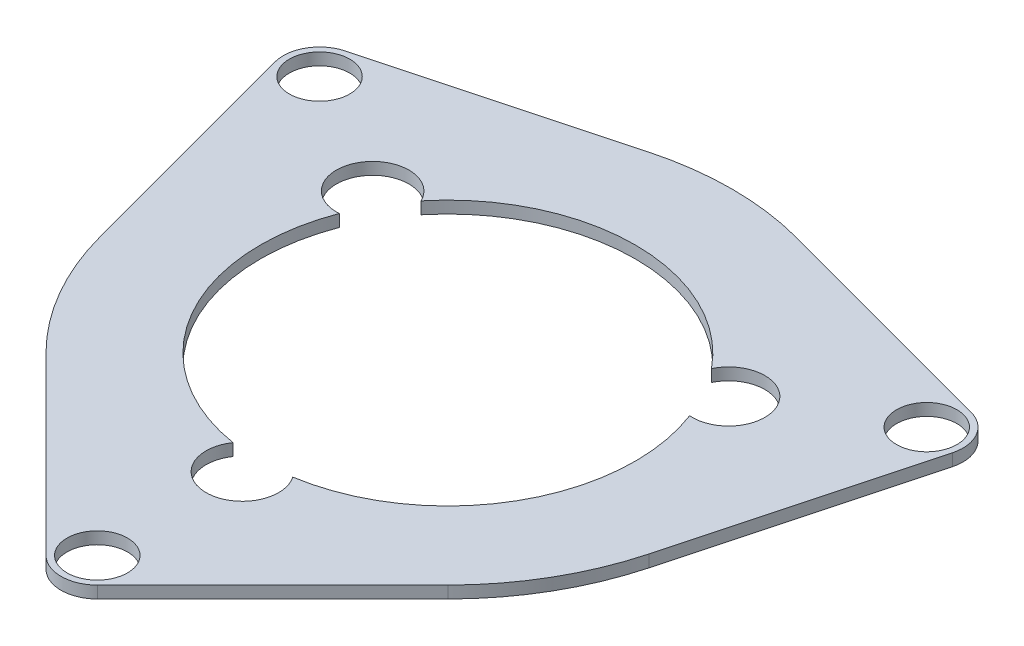
ISO-10303-21;
HEADER;
FILE_DESCRIPTION(('STEP AP214'),'2;1');
FILE_NAME('part.step','',(''),(''),'','','');
FILE_SCHEMA(('AUTOMOTIVE_DESIGN { 1 0 10303 214 1 1 1 1 }'));
ENDSEC;
DATA;
#1=APPLICATION_CONTEXT('core data for automotive mechanical design processes');
#2=APPLICATION_PROTOCOL_DEFINITION('international standard','automotive_design',2000,#1);
#3=PRODUCT_CONTEXT('',#1,'mechanical');
#4=PRODUCT('Part','Part','',(#3));
#5=PRODUCT_RELATED_PRODUCT_CATEGORY('part','',(#4));
#6=PRODUCT_DEFINITION_FORMATION('','',#4);
#7=PRODUCT_DEFINITION_CONTEXT('part definition',#1,'design');
#8=PRODUCT_DEFINITION('design','',#6,#7);
#9=PRODUCT_DEFINITION_SHAPE('','',#8);
#10=(LENGTH_UNIT() NAMED_UNIT(*) SI_UNIT(.MILLI.,.METRE.));
#11=(NAMED_UNIT(*) PLANE_ANGLE_UNIT() SI_UNIT($,.RADIAN.));
#12=(NAMED_UNIT(*) SI_UNIT($,.STERADIAN.) SOLID_ANGLE_UNIT());
#13=UNCERTAINTY_MEASURE_WITH_UNIT(LENGTH_MEASURE(1.E-05),#10,'distance_accuracy_value','');
#14=(GEOMETRIC_REPRESENTATION_CONTEXT(3) GLOBAL_UNCERTAINTY_ASSIGNED_CONTEXT((#13)) GLOBAL_UNIT_ASSIGNED_CONTEXT((#10,
#11,#12)) REPRESENTATION_CONTEXT('',''));
#15=CARTESIAN_POINT('',(0.,0.,0.));
#16=DIRECTION('',(0.,0.,1.));
#17=DIRECTION('',(1.,0.,0.));
#18=AXIS2_PLACEMENT_3D('',#15,#16,#17);
#19=CARTESIAN_POINT('',(0.,0.5,0.));
#20=DIRECTION('',(0.,-1.,0.));
#21=DIRECTION('',(0.,0.,-1.));
#22=AXIS2_PLACEMENT_3D('',#19,#20,#21);
#23=PLANE('',#22);
#24=CARTESIAN_POINT('',(0.,0.5,14.4999999999999));
#25=DIRECTION('',(0.,1.,0.));
#26=DIRECTION('',(0.,0.,1.));
#27=AXIS2_PLACEMENT_3D('',#24,#25,#26);
#28=CIRCLE('',#27,1.25);
#29=CARTESIAN_POINT('',(0.,0.5,15.7499999999999));
#30=VERTEX_POINT('',#29);
#31=EDGE_CURVE('E209',#30,#30,#28,.T.);
#32=ORIENTED_EDGE('',*,*,#31,.F.);
#33=EDGE_LOOP('',(#32));
#34=FACE_BOUND('',#33,.T.);
#35=CARTESIAN_POINT('',(-12.5573683548744,0.5,-7.24999999999988));
#36=DIRECTION('',(0.,1.,0.));
#37=DIRECTION('',(0.,0.,1.));
#38=AXIS2_PLACEMENT_3D('',#35,#36,#37);
#39=CIRCLE('',#38,1.25);
#40=CARTESIAN_POINT('',(-12.5573683548744,0.5,-5.99999999999988));
#41=VERTEX_POINT('',#40);
#42=EDGE_CURVE('E221',#41,#41,#39,.T.);
#43=ORIENTED_EDGE('',*,*,#42,.F.);
#44=EDGE_LOOP('',(#43));
#45=FACE_BOUND('',#44,.T.);
#46=CARTESIAN_POINT('',(0.,0.5,0.));
#47=DIRECTION('',(0.,1.,0.));
#48=DIRECTION('',(0.,0.,-1.));
#49=AXIS2_PLACEMENT_3D('',#46,#47,#48);
#50=CIRCLE('',#49,11.753048327205);
#51=CARTESIAN_POINT('',(3.0419127450911,0.5,-11.3525729168708));
#52=VERTEX_POINT('',#51);
#53=CARTESIAN_POINT('',(-3.0419127450911,0.5,-11.3525729168708));
#54=VERTEX_POINT('',#53);
#55=EDGE_CURVE('E227',#52,#54,#50,.T.);
#56=ORIENTED_EDGE('',*,*,#55,.T.);
#57=DIRECTION('',(-0.965925826289065,0.,0.258819045102533));
#58=VECTOR('',#57,1.);
#59=CARTESIAN_POINT('',(-3.0419127450911,0.5,-11.3525729168708));
#60=LINE('',#59,#58);
#61=CARTESIAN_POINT('',(-12.9455969225282,0.5,-8.69888873943348));
#62=VERTEX_POINT('',#61);
#63=EDGE_CURVE('E230',#54,#62,#60,.T.);
#64=ORIENTED_EDGE('',*,*,#63,.T.);
#65=CARTESIAN_POINT('',(-12.5573683548744,0.5,-7.24999999999988));
#66=DIRECTION('',(0.,1.,0.));
#67=DIRECTION('',(0.,0.,-1.));
#68=AXIS2_PLACEMENT_3D('',#65,#66,#67);
#69=CIRCLE('',#68,1.5);
#70=CARTESIAN_POINT('',(-14.006257094308,0.5,-6.86177143234609));
#71=VERTEX_POINT('',#70);
#72=EDGE_CURVE('E233',#62,#71,#69,.T.);
#73=ORIENTED_EDGE('',*,*,#72,.T.);
#74=DIRECTION('',(0.258819045102528,0.,0.965925826289066));
#75=VECTOR('',#74,1.);
#76=CARTESIAN_POINT('',(-11.3525729168708,0.5,3.04191274509105));
#77=LINE('',#76,#75);
#78=CARTESIAN_POINT('',(-11.3525729168708,0.5,3.04191274509105));
#79=VERTEX_POINT('',#78);
#80=EDGE_CURVE('E235',#71,#79,#77,.T.);
#81=ORIENTED_EDGE('',*,*,#80,.T.);
#82=CARTESIAN_POINT('',(0.,0.5,0.));
#83=DIRECTION('',(0.,1.,0.));
#84=DIRECTION('',(0.,0.,1.));
#85=AXIS2_PLACEMENT_3D('',#82,#83,#84);
#86=CIRCLE('',#85,11.753048327205);
#87=CARTESIAN_POINT('',(-8.31066017177983,0.5,8.31066017177985));
#88=VERTEX_POINT('',#87);
#89=EDGE_CURVE('E237',#79,#88,#86,.T.);
#90=ORIENTED_EDGE('',*,*,#89,.T.);
#91=DIRECTION('',(0.707106781186549,0.,0.707106781186546));
#92=VECTOR('',#91,1.);
#93=CARTESIAN_POINT('',(-8.31066017177982,0.5,8.31066017177985));
#94=LINE('',#93,#92);
#95=CARTESIAN_POINT('',(-1.06066017177982,0.5,15.5606601717798));
#96=VERTEX_POINT('',#95);
#97=EDGE_CURVE('E239',#88,#96,#94,.T.);
#98=ORIENTED_EDGE('',*,*,#97,.T.);
#99=CARTESIAN_POINT('',(0.,0.5,14.4999999999999));
#100=DIRECTION('',(0.,1.,0.));
#101=DIRECTION('',(0.,0.,1.));
#102=AXIS2_PLACEMENT_3D('',#99,#100,#101);
#103=CIRCLE('',#102,1.50000000000005);
#104=CARTESIAN_POINT('',(1.06066017177982,0.5,15.5606601717798));
#105=VERTEX_POINT('',#104);
#106=EDGE_CURVE('E241',#96,#105,#103,.T.);
#107=ORIENTED_EDGE('',*,*,#106,.T.);
#108=DIRECTION('',(0.707106781186548,0.,-0.707106781186547));
#109=VECTOR('',#108,1.);
#110=CARTESIAN_POINT('',(8.31066017177982,0.5,8.31066017177985));
#111=LINE('',#110,#109);
#112=CARTESIAN_POINT('',(8.31066017177982,0.5,8.31066017177985));
#113=VERTEX_POINT('',#112);
#114=EDGE_CURVE('E243',#105,#113,#111,.T.);
#115=ORIENTED_EDGE('',*,*,#114,.T.);
#116=CARTESIAN_POINT('',(0.,0.5,0.));
#117=DIRECTION('',(0.,1.,0.));
#118=DIRECTION('',(0.,0.,-1.));
#119=AXIS2_PLACEMENT_3D('',#116,#117,#118);
#120=CIRCLE('',#119,11.753048327205);
#121=CARTESIAN_POINT('',(11.3525729168708,0.5,3.04191274509105));
#122=VERTEX_POINT('',#121);
#123=EDGE_CURVE('E245',#113,#122,#120,.T.);
#124=ORIENTED_EDGE('',*,*,#123,.T.);
#125=DIRECTION('',(0.258819045102527,0.,-0.965925826289067));
#126=VECTOR('',#125,1.);
#127=CARTESIAN_POINT('',(11.3525729168708,0.5,3.04191274509105));
#128=LINE('',#127,#126);
#129=CARTESIAN_POINT('',(14.006257094308,0.5,-6.8617714323461));
#130=VERTEX_POINT('',#129);
#131=EDGE_CURVE('E247',#122,#130,#128,.T.);
#132=ORIENTED_EDGE('',*,*,#131,.T.);
#133=CARTESIAN_POINT('',(12.5573683548744,0.5,-7.24999999999991));
#134=DIRECTION('',(0.,1.,0.));
#135=DIRECTION('',(0.,0.,-1.));
#136=AXIS2_PLACEMENT_3D('',#133,#134,#135);
#137=CIRCLE('',#136,1.49999999999999);
#138=CARTESIAN_POINT('',(12.9455969225282,0.5,-8.69888873943349));
#139=VERTEX_POINT('',#138);
#140=EDGE_CURVE('E249',#130,#139,#137,.T.);
#141=ORIENTED_EDGE('',*,*,#140,.T.);
#142=DIRECTION('',(-0.965925826289065,0.,-0.258819045102532));
#143=VECTOR('',#142,1.);
#144=CARTESIAN_POINT('',(3.0419127450911,0.5,-11.3525729168708));
#145=LINE('',#144,#143);
#146=EDGE_CURVE('E251',#139,#52,#145,.T.);
#147=ORIENTED_EDGE('',*,*,#146,.T.);
#148=EDGE_LOOP('',(#56,#64,#73,#81,#90,#98,#107,#115,#124,#132,#141,#147));
#149=FACE_BOUND('',#148,.T.);
#150=CARTESIAN_POINT('',(12.5573683548744,0.5,-7.24999999999991));
#151=DIRECTION('',(0.,1.,0.));
#152=DIRECTION('',(0.,0.,1.));
#153=AXIS2_PLACEMENT_3D('',#150,#151,#152);
#154=CIRCLE('',#153,1.25);
#155=CARTESIAN_POINT('',(12.5573683548744,0.5,-5.99999999999991));
#156=VERTEX_POINT('',#155);
#157=EDGE_CURVE('E215',#156,#156,#154,.T.);
#158=ORIENTED_EDGE('',*,*,#157,.F.);
#159=EDGE_LOOP('',(#158));
#160=FACE_BOUND('',#159,.T.);
#161=CARTESIAN_POINT('',(0.,0.5,0.));
#162=DIRECTION('',(0.,1.,0.));
#163=DIRECTION('',(0.,0.,-1.));
#164=AXIS2_PLACEMENT_3D('',#161,#162,#163);
#165=CIRCLE('',#164,7.75);
#166=CARTESIAN_POINT('',(6.00751808071081,0.5,-4.89614404505553));
#167=VERTEX_POINT('',#166);
#168=CARTESIAN_POINT('',(-6.00751808071081,0.5,-4.89614404505553));
#169=VERTEX_POINT('',#168);
#170=EDGE_CURVE('E158',#167,#169,#165,.T.);
#171=ORIENTED_EDGE('',*,*,#170,.F.);
#172=CARTESIAN_POINT('',(7.36121593216777,0.5,-4.24999999999993));
#173=DIRECTION('',(0.,1.,0.));
#174=DIRECTION('',(0.,0.,-1.));
#175=AXIS2_PLACEMENT_3D('',#172,#173,#174);
#176=CIRCLE('',#175,1.5);
#177=CARTESIAN_POINT('',(7.24394416396144,0.5,-2.754591249062));
#178=VERTEX_POINT('',#177);
#179=EDGE_CURVE('E187',#178,#167,#176,.T.);
#180=ORIENTED_EDGE('',*,*,#179,.F.);
#181=CARTESIAN_POINT('',(0.,0.5,0.));
#182=DIRECTION('',(0.,1.,0.));
#183=DIRECTION('',(0.,0.,-1.));
#184=AXIS2_PLACEMENT_3D('',#181,#182,#183);
#185=CIRCLE('',#184,7.75);
#186=CARTESIAN_POINT('',(1.23642608325066,0.5,7.65073529411765));
#187=VERTEX_POINT('',#186);
#188=EDGE_CURVE('E185',#187,#178,#185,.T.);
#189=ORIENTED_EDGE('',*,*,#188,.F.);
#190=CARTESIAN_POINT('',(0.,0.5,8.5));
#191=DIRECTION('',(0.,1.,0.));
#192=DIRECTION('',(0.,0.,-1.));
#193=AXIS2_PLACEMENT_3D('',#190,#191,#192);
#194=CIRCLE('',#193,1.5);
#195=CARTESIAN_POINT('',(-1.23642608325065,0.5,7.65073529411765));
#196=VERTEX_POINT('',#195);
#197=EDGE_CURVE('E181',#196,#187,#194,.T.);
#198=ORIENTED_EDGE('',*,*,#197,.F.);
#199=CARTESIAN_POINT('',(0.,0.5,0.));
#200=DIRECTION('',(0.,1.,0.));
#201=DIRECTION('',(0.,0.,-1.));
#202=AXIS2_PLACEMENT_3D('',#199,#200,#201);
#203=CIRCLE('',#202,7.75);
#204=CARTESIAN_POINT('',(-7.24394416396144,0.5,-2.75459124906199));
#205=VERTEX_POINT('',#204);
#206=EDGE_CURVE('E179',#205,#196,#203,.T.);
#207=ORIENTED_EDGE('',*,*,#206,.F.);
#208=CARTESIAN_POINT('',(-7.36121593216777,0.5,-4.24999999999993));
#209=DIRECTION('',(0.,1.,0.));
#210=DIRECTION('',(0.,0.,-1.));
#211=AXIS2_PLACEMENT_3D('',#208,#209,#210);
#212=CIRCLE('',#211,1.5);
#213=EDGE_CURVE('E166',#169,#205,#212,.T.);
#214=ORIENTED_EDGE('',*,*,#213,.F.);
#215=EDGE_LOOP('',(#171,#180,#189,#198,#207,#214));
#216=FACE_BOUND('',#215,.T.);
#217=ADVANCED_FACE('F33',(#34,#45,#149,#160,#216),#23,.F.);
#218=CARTESIAN_POINT('',(0.,0.,0.));
#219=DIRECTION('',(0.,-1.,0.));
#220=DIRECTION('',(0.,0.,-1.));
#221=AXIS2_PLACEMENT_3D('',#218,#219,#220);
#222=PLANE('',#221);
#223=CARTESIAN_POINT('',(0.,0.,14.4999999999999));
#224=DIRECTION('',(0.,1.,0.));
#225=DIRECTION('',(0.,0.,1.));
#226=AXIS2_PLACEMENT_3D('',#223,#224,#225);
#227=CIRCLE('',#226,1.25);
#228=CARTESIAN_POINT('',(0.,0.,15.7499999999999));
#229=VERTEX_POINT('',#228);
#230=EDGE_CURVE('E174',#229,#229,#227,.T.);
#231=ORIENTED_EDGE('',*,*,#230,.T.);
#232=EDGE_LOOP('',(#231));
#233=FACE_BOUND('',#232,.T.);
#234=CARTESIAN_POINT('',(-12.5573683548744,0.,-7.24999999999988));
#235=DIRECTION('',(0.,1.,0.));
#236=DIRECTION('',(0.,0.,1.));
#237=AXIS2_PLACEMENT_3D('',#234,#235,#236);
#238=CIRCLE('',#237,1.25);
#239=CARTESIAN_POINT('',(-12.5573683548744,0.,-5.99999999999988));
#240=VERTEX_POINT('',#239);
#241=EDGE_CURVE('E218',#240,#240,#238,.T.);
#242=ORIENTED_EDGE('',*,*,#241,.T.);
#243=EDGE_LOOP('',(#242));
#244=FACE_BOUND('',#243,.T.);
#245=CARTESIAN_POINT('',(0.,0.,0.));
#246=DIRECTION('',(0.,1.,0.));
#247=DIRECTION('',(0.,0.,-1.));
#248=AXIS2_PLACEMENT_3D('',#245,#246,#247);
#249=CIRCLE('',#248,11.753048327205);
#250=CARTESIAN_POINT('',(3.0419127450911,0.,-11.3525729168708));
#251=VERTEX_POINT('',#250);
#252=CARTESIAN_POINT('',(-3.0419127450911,0.,-11.3525729168708));
#253=VERTEX_POINT('',#252);
#254=EDGE_CURVE('E224',#251,#253,#249,.T.);
#255=ORIENTED_EDGE('',*,*,#254,.F.);
#256=DIRECTION('',(-0.965925826289065,0.,-0.258819045102532));
#257=VECTOR('',#256,1.);
#258=CARTESIAN_POINT('',(3.0419127450911,0.,-11.3525729168708));
#259=LINE('',#258,#257);
#260=CARTESIAN_POINT('',(12.9455969225282,0.,-8.69888873943349));
#261=VERTEX_POINT('',#260);
#262=EDGE_CURVE('E231',#261,#251,#259,.T.);
#263=ORIENTED_EDGE('',*,*,#262,.F.);
#264=CARTESIAN_POINT('',(12.5573683548744,0.,-7.24999999999991));
#265=DIRECTION('',(0.,1.,0.));
#266=DIRECTION('',(0.,0.,-1.));
#267=AXIS2_PLACEMENT_3D('',#264,#265,#266);
#268=CIRCLE('',#267,1.49999999999999);
#269=CARTESIAN_POINT('',(14.006257094308,0.,-6.8617714323461));
#270=VERTEX_POINT('',#269);
#271=EDGE_CURVE('E274',#270,#261,#268,.T.);
#272=ORIENTED_EDGE('',*,*,#271,.F.);
#273=DIRECTION('',(0.258819045102527,0.,-0.965925826289067));
#274=VECTOR('',#273,1.);
#275=CARTESIAN_POINT('',(11.3525729168708,0.,3.04191274509105));
#276=LINE('',#275,#274);
#277=CARTESIAN_POINT('',(11.3525729168708,0.,3.04191274509105));
#278=VERTEX_POINT('',#277);
#279=EDGE_CURVE('E272',#278,#270,#276,.T.);
#280=ORIENTED_EDGE('',*,*,#279,.F.);
#281=CARTESIAN_POINT('',(0.,0.,0.));
#282=DIRECTION('',(0.,1.,0.));
#283=DIRECTION('',(0.,0.,-1.));
#284=AXIS2_PLACEMENT_3D('',#281,#282,#283);
#285=CIRCLE('',#284,11.753048327205);
#286=CARTESIAN_POINT('',(8.31066017177982,0.,8.31066017177985));
#287=VERTEX_POINT('',#286);
#288=EDGE_CURVE('E270',#287,#278,#285,.T.);
#289=ORIENTED_EDGE('',*,*,#288,.F.);
#290=DIRECTION('',(0.707106781186548,0.,-0.707106781186547));
#291=VECTOR('',#290,1.);
#292=CARTESIAN_POINT('',(8.31066017177982,0.,8.31066017177985));
#293=LINE('',#292,#291);
#294=CARTESIAN_POINT('',(1.06066017177982,0.,15.5606601717798));
#295=VERTEX_POINT('',#294);
#296=EDGE_CURVE('E268',#295,#287,#293,.T.);
#297=ORIENTED_EDGE('',*,*,#296,.F.);
#298=CARTESIAN_POINT('',(0.,0.,14.4999999999999));
#299=DIRECTION('',(0.,1.,0.));
#300=DIRECTION('',(0.,0.,1.));
#301=AXIS2_PLACEMENT_3D('',#298,#299,#300);
#302=CIRCLE('',#301,1.50000000000005);
#303=CARTESIAN_POINT('',(-1.06066017177982,0.,15.5606601717798));
#304=VERTEX_POINT('',#303);
#305=EDGE_CURVE('E266',#304,#295,#302,.T.);
#306=ORIENTED_EDGE('',*,*,#305,.F.);
#307=DIRECTION('',(0.707106781186549,0.,0.707106781186546));
#308=VECTOR('',#307,1.);
#309=CARTESIAN_POINT('',(-8.31066017177982,0.,8.31066017177985));
#310=LINE('',#309,#308);
#311=CARTESIAN_POINT('',(-8.31066017177983,0.,8.31066017177985));
#312=VERTEX_POINT('',#311);
#313=EDGE_CURVE('E264',#312,#304,#310,.T.);
#314=ORIENTED_EDGE('',*,*,#313,.F.);
#315=CARTESIAN_POINT('',(0.,0.,0.));
#316=DIRECTION('',(0.,1.,0.));
#317=DIRECTION('',(0.,0.,1.));
#318=AXIS2_PLACEMENT_3D('',#315,#316,#317);
#319=CIRCLE('',#318,11.753048327205);
#320=CARTESIAN_POINT('',(-11.3525729168708,0.,3.04191274509105));
#321=VERTEX_POINT('',#320);
#322=EDGE_CURVE('E262',#321,#312,#319,.T.);
#323=ORIENTED_EDGE('',*,*,#322,.F.);
#324=DIRECTION('',(0.258819045102528,0.,0.965925826289066));
#325=VECTOR('',#324,1.);
#326=CARTESIAN_POINT('',(-11.3525729168708,0.,3.04191274509105));
#327=LINE('',#326,#325);
#328=CARTESIAN_POINT('',(-14.006257094308,0.,-6.86177143234609));
#329=VERTEX_POINT('',#328);
#330=EDGE_CURVE('E260',#329,#321,#327,.T.);
#331=ORIENTED_EDGE('',*,*,#330,.F.);
#332=CARTESIAN_POINT('',(-12.5573683548744,0.,-7.24999999999988));
#333=DIRECTION('',(0.,1.,0.));
#334=DIRECTION('',(0.,0.,-1.));
#335=AXIS2_PLACEMENT_3D('',#332,#333,#334);
#336=CIRCLE('',#335,1.5);
#337=CARTESIAN_POINT('',(-12.9455969225282,0.,-8.69888873943348));
#338=VERTEX_POINT('',#337);
#339=EDGE_CURVE('E258',#338,#329,#336,.T.);
#340=ORIENTED_EDGE('',*,*,#339,.F.);
#341=DIRECTION('',(-0.965925826289065,0.,0.258819045102533));
#342=VECTOR('',#341,1.);
#343=CARTESIAN_POINT('',(-3.0419127450911,0.,-11.3525729168708));
#344=LINE('',#343,#342);
#345=EDGE_CURVE('E256',#253,#338,#344,.T.);
#346=ORIENTED_EDGE('',*,*,#345,.F.);
#347=EDGE_LOOP('',(#255,#263,#272,#280,#289,#297,#306,#314,#323,#331,#340,#346));
#348=FACE_BOUND('',#347,.T.);
#349=CARTESIAN_POINT('',(12.5573683548744,0.,-7.24999999999991));
#350=DIRECTION('',(0.,1.,0.));
#351=DIRECTION('',(0.,0.,1.));
#352=AXIS2_PLACEMENT_3D('',#349,#350,#351);
#353=CIRCLE('',#352,1.25);
#354=CARTESIAN_POINT('',(12.5573683548744,0.,-5.99999999999991));
#355=VERTEX_POINT('',#354);
#356=EDGE_CURVE('E212',#355,#355,#353,.T.);
#357=ORIENTED_EDGE('',*,*,#356,.T.);
#358=EDGE_LOOP('',(#357));
#359=FACE_BOUND('',#358,.T.);
#360=CARTESIAN_POINT('',(7.36121593216777,0.,-4.24999999999993));
#361=DIRECTION('',(0.,1.,0.));
#362=DIRECTION('',(0.,0.,-1.));
#363=AXIS2_PLACEMENT_3D('',#360,#361,#362);
#364=CIRCLE('',#363,1.5);
#365=CARTESIAN_POINT('',(7.24394416396144,0.,-2.754591249062));
#366=VERTEX_POINT('',#365);
#367=CARTESIAN_POINT('',(6.00751808071081,0.,-4.89614404505553));
#368=VERTEX_POINT('',#367);
#369=EDGE_CURVE('E167',#366,#368,#364,.T.);
#370=ORIENTED_EDGE('',*,*,#369,.T.);
#371=CARTESIAN_POINT('',(0.,0.,0.));
#372=DIRECTION('',(0.,1.,0.));
#373=DIRECTION('',(0.,0.,-1.));
#374=AXIS2_PLACEMENT_3D('',#371,#372,#373);
#375=CIRCLE('',#374,7.75);
#376=CARTESIAN_POINT('',(-6.00751808071081,0.,-4.89614404505553));
#377=VERTEX_POINT('',#376);
#378=EDGE_CURVE('E56',#368,#377,#375,.T.);
#379=ORIENTED_EDGE('',*,*,#378,.T.);
#380=CARTESIAN_POINT('',(-7.36121593216777,0.,-4.24999999999993));
#381=DIRECTION('',(0.,1.,0.));
#382=DIRECTION('',(0.,0.,-1.));
#383=AXIS2_PLACEMENT_3D('',#380,#381,#382);
#384=CIRCLE('',#383,1.5);
#385=CARTESIAN_POINT('',(-7.24394416396144,0.,-2.75459124906199));
#386=VERTEX_POINT('',#385);
#387=EDGE_CURVE('E173',#377,#386,#384,.T.);
#388=ORIENTED_EDGE('',*,*,#387,.T.);
#389=CARTESIAN_POINT('',(0.,0.,0.));
#390=DIRECTION('',(0.,1.,0.));
#391=DIRECTION('',(0.,0.,-1.));
#392=AXIS2_PLACEMENT_3D('',#389,#390,#391);
#393=CIRCLE('',#392,7.75);
#394=CARTESIAN_POINT('',(-1.23642608325065,0.,7.65073529411765));
#395=VERTEX_POINT('',#394);
#396=EDGE_CURVE('E191',#386,#395,#393,.T.);
#397=ORIENTED_EDGE('',*,*,#396,.T.);
#398=CARTESIAN_POINT('',(0.,0.,8.5));
#399=DIRECTION('',(0.,1.,0.));
#400=DIRECTION('',(0.,0.,-1.));
#401=AXIS2_PLACEMENT_3D('',#398,#399,#400);
#402=CIRCLE('',#401,1.5);
#403=CARTESIAN_POINT('',(1.23642608325066,0.,7.65073529411765));
#404=VERTEX_POINT('',#403);
#405=EDGE_CURVE('E194',#395,#404,#402,.T.);
#406=ORIENTED_EDGE('',*,*,#405,.T.);
#407=CARTESIAN_POINT('',(0.,0.,0.));
#408=DIRECTION('',(0.,1.,0.));
#409=DIRECTION('',(0.,0.,-1.));
#410=AXIS2_PLACEMENT_3D('',#407,#408,#409);
#411=CIRCLE('',#410,7.75);
#412=EDGE_CURVE('E197',#404,#366,#411,.T.);
#413=ORIENTED_EDGE('',*,*,#412,.T.);
#414=EDGE_LOOP('',(#370,#379,#388,#397,#406,#413));
#415=FACE_BOUND('',#414,.T.);
#416=ADVANCED_FACE('F316',(#233,#244,#348,#359,#415),#222,.T.);
#417=CARTESIAN_POINT('',(0.,0.5,0.));
#418=DIRECTION('',(0.,-1.,0.));
#419=DIRECTION('',(0.,0.,-1.));
#420=AXIS2_PLACEMENT_3D('',#417,#418,#419);
#421=CYLINDRICAL_SURFACE('',#420,11.753048327205);
#422=ORIENTED_EDGE('',*,*,#254,.T.);
#423=DIRECTION('',(0.,-1.,0.));
#424=VECTOR('',#423,1.);
#425=CARTESIAN_POINT('',(-3.0419127450911,0.5,-11.3525729168708));
#426=LINE('',#425,#424);
#427=EDGE_CURVE('E11',#54,#253,#426,.T.);
#428=ORIENTED_EDGE('',*,*,#427,.F.);
#429=ORIENTED_EDGE('',*,*,#55,.F.);
#430=DIRECTION('',(0.,-1.,0.));
#431=VECTOR('',#430,1.);
#432=CARTESIAN_POINT('',(3.0419127450911,0.5,-11.3525729168708));
#433=LINE('',#432,#431);
#434=EDGE_CURVE('E253',#52,#251,#433,.T.);
#435=ORIENTED_EDGE('',*,*,#434,.T.);
#436=EDGE_LOOP('',(#422,#428,#429,#435));
#437=FACE_BOUND('',#436,.T.);
#438=ADVANCED_FACE('F35',(#437),#421,.T.);
#439=CARTESIAN_POINT('',(-3.0419127450911,0.5,-11.3525729168708));
#440=DIRECTION('',(0.258819045102533,0.,0.965925826289065));
#441=DIRECTION('',(0.965925826289065,0.,-0.258819045102533));
#442=AXIS2_PLACEMENT_3D('',#439,#440,#441);
#443=PLANE('',#442);
#444=ORIENTED_EDGE('',*,*,#345,.T.);
#445=DIRECTION('',(0.,-1.,0.));
#446=VECTOR('',#445,1.);
#447=CARTESIAN_POINT('',(-12.9455969225282,0.5,-8.69888873943348));
#448=LINE('',#447,#446);
#449=EDGE_CURVE('E41',#62,#338,#448,.T.);
#450=ORIENTED_EDGE('',*,*,#449,.F.);
#451=ORIENTED_EDGE('',*,*,#63,.F.);
#452=ORIENTED_EDGE('',*,*,#427,.T.);
#453=EDGE_LOOP('',(#444,#450,#451,#452));
#454=FACE_BOUND('',#453,.T.);
#455=ADVANCED_FACE('F334',(#454),#443,.F.);
#456=CARTESIAN_POINT('',(-12.5573683548744,0.5,-7.24999999999988));
#457=DIRECTION('',(0.,-1.,0.));
#458=DIRECTION('',(0.,0.,-1.));
#459=AXIS2_PLACEMENT_3D('',#456,#457,#458);
#460=CYLINDRICAL_SURFACE('',#459,1.5);
#461=ORIENTED_EDGE('',*,*,#339,.T.);
#462=DIRECTION('',(0.,-1.,0.));
#463=VECTOR('',#462,1.);
#464=CARTESIAN_POINT('',(-14.006257094308,0.5,-6.86177143234609));
#465=LINE('',#464,#463);
#466=EDGE_CURVE('E303',#71,#329,#465,.T.);
#467=ORIENTED_EDGE('',*,*,#466,.F.);
#468=ORIENTED_EDGE('',*,*,#72,.F.);
#469=ORIENTED_EDGE('',*,*,#449,.T.);
#470=EDGE_LOOP('',(#461,#467,#468,#469));
#471=FACE_BOUND('',#470,.T.);
#472=ADVANCED_FACE('F310',(#471),#460,.T.);
#473=CARTESIAN_POINT('',(-11.3525729168708,0.5,3.04191274509105));
#474=DIRECTION('',(0.965925826289067,0.,-0.258819045102528));
#475=DIRECTION('',(-0.258819045102528,0.,-0.965925826289067));
#476=AXIS2_PLACEMENT_3D('',#473,#474,#475);
#477=PLANE('',#476);
#478=ORIENTED_EDGE('',*,*,#330,.T.);
#479=DIRECTION('',(0.,-1.,0.));
#480=VECTOR('',#479,1.);
#481=CARTESIAN_POINT('',(-11.3525729168708,0.5,3.04191274509105));
#482=LINE('',#481,#480);
#483=EDGE_CURVE('E300',#79,#321,#482,.T.);
#484=ORIENTED_EDGE('',*,*,#483,.F.);
#485=ORIENTED_EDGE('',*,*,#80,.F.);
#486=ORIENTED_EDGE('',*,*,#466,.T.);
#487=EDGE_LOOP('',(#478,#484,#485,#486));
#488=FACE_BOUND('',#487,.T.);
#489=ADVANCED_FACE('F322',(#488),#477,.F.);
#490=CARTESIAN_POINT('',(0.,0.5,0.));
#491=DIRECTION('',(0.,-1.,0.));
#492=DIRECTION('',(0.,0.,-1.));
#493=AXIS2_PLACEMENT_3D('',#490,#491,#492);
#494=CYLINDRICAL_SURFACE('',#493,11.753048327205);
#495=ORIENTED_EDGE('',*,*,#322,.T.);
#496=DIRECTION('',(0.,-1.,0.));
#497=VECTOR('',#496,1.);
#498=CARTESIAN_POINT('',(-8.31066017177983,0.5,8.31066017177985));
#499=LINE('',#498,#497);
#500=EDGE_CURVE('E297',#88,#312,#499,.T.);
#501=ORIENTED_EDGE('',*,*,#500,.F.);
#502=ORIENTED_EDGE('',*,*,#89,.F.);
#503=ORIENTED_EDGE('',*,*,#483,.T.);
#504=EDGE_LOOP('',(#495,#501,#502,#503));
#505=FACE_BOUND('',#504,.T.);
#506=ADVANCED_FACE('F326',(#505),#494,.T.);
#507=CARTESIAN_POINT('',(-8.31066017177982,0.5,8.31066017177985));
#508=DIRECTION('',(0.707106781186546,0.,-0.707106781186549));
#509=DIRECTION('',(-0.707106781186549,0.,-0.707106781186546));
#510=AXIS2_PLACEMENT_3D('',#507,#508,#509);
#511=PLANE('',#510);
#512=ORIENTED_EDGE('',*,*,#313,.T.);
#513=DIRECTION('',(0.,-1.,0.));
#514=VECTOR('',#513,1.);
#515=CARTESIAN_POINT('',(-1.06066017177982,0.5,15.5606601717798));
#516=LINE('',#515,#514);
#517=EDGE_CURVE('E294',#96,#304,#516,.T.);
#518=ORIENTED_EDGE('',*,*,#517,.F.);
#519=ORIENTED_EDGE('',*,*,#97,.F.);
#520=ORIENTED_EDGE('',*,*,#500,.T.);
#521=EDGE_LOOP('',(#512,#518,#519,#520));
#522=FACE_BOUND('',#521,.T.);
#523=ADVANCED_FACE('F367',(#522),#511,.F.);
#524=CARTESIAN_POINT('',(0.,0.5,14.4999999999999));
#525=DIRECTION('',(0.,-1.,0.));
#526=DIRECTION('',(0.,0.,-1.));
#527=AXIS2_PLACEMENT_3D('',#524,#525,#526);
#528=CYLINDRICAL_SURFACE('',#527,1.50000000000005);
#529=ORIENTED_EDGE('',*,*,#305,.T.);
#530=DIRECTION('',(0.,-1.,0.));
#531=VECTOR('',#530,1.);
#532=CARTESIAN_POINT('',(1.06066017177982,0.5,15.5606601717798));
#533=LINE('',#532,#531);
#534=EDGE_CURVE('E291',#105,#295,#533,.T.);
#535=ORIENTED_EDGE('',*,*,#534,.F.);
#536=ORIENTED_EDGE('',*,*,#106,.F.);
#537=ORIENTED_EDGE('',*,*,#517,.T.);
#538=EDGE_LOOP('',(#529,#535,#536,#537));
#539=FACE_BOUND('',#538,.T.);
#540=ADVANCED_FACE('F365',(#539),#528,.T.);
#541=CARTESIAN_POINT('',(8.31066017177982,0.5,8.31066017177985));
#542=DIRECTION('',(-0.707106781186547,0.,-0.707106781186548));
#543=DIRECTION('',(-0.707106781186548,0.,0.707106781186547));
#544=AXIS2_PLACEMENT_3D('',#541,#542,#543);
#545=PLANE('',#544);
#546=ORIENTED_EDGE('',*,*,#296,.T.);
#547=DIRECTION('',(0.,-1.,0.));
#548=VECTOR('',#547,1.);
#549=CARTESIAN_POINT('',(8.31066017177982,0.5,8.31066017177985));
#550=LINE('',#549,#548);
#551=EDGE_CURVE('E288',#113,#287,#550,.T.);
#552=ORIENTED_EDGE('',*,*,#551,.F.);
#553=ORIENTED_EDGE('',*,*,#114,.F.);
#554=ORIENTED_EDGE('',*,*,#534,.T.);
#555=EDGE_LOOP('',(#546,#552,#553,#554));
#556=FACE_BOUND('',#555,.T.);
#557=ADVANCED_FACE('F361',(#556),#545,.F.);
#558=CARTESIAN_POINT('',(0.,0.5,0.));
#559=DIRECTION('',(0.,-1.,0.));
#560=DIRECTION('',(0.,0.,-1.));
#561=AXIS2_PLACEMENT_3D('',#558,#559,#560);
#562=CYLINDRICAL_SURFACE('',#561,11.753048327205);
#563=ORIENTED_EDGE('',*,*,#288,.T.);
#564=DIRECTION('',(0.,-1.,0.));
#565=VECTOR('',#564,1.);
#566=CARTESIAN_POINT('',(11.3525729168708,0.5,3.04191274509105));
#567=LINE('',#566,#565);
#568=EDGE_CURVE('E285',#122,#278,#567,.T.);
#569=ORIENTED_EDGE('',*,*,#568,.F.);
#570=ORIENTED_EDGE('',*,*,#123,.F.);
#571=ORIENTED_EDGE('',*,*,#551,.T.);
#572=EDGE_LOOP('',(#563,#569,#570,#571));
#573=FACE_BOUND('',#572,.T.);
#574=ADVANCED_FACE('F356',(#573),#562,.T.);
#575=CARTESIAN_POINT('',(11.3525729168708,0.5,3.04191274509105));
#576=DIRECTION('',(-0.965925826289066,0.,-0.258819045102527));
#577=DIRECTION('',(-0.258819045102527,0.,0.965925826289067));
#578=AXIS2_PLACEMENT_3D('',#575,#576,#577);
#579=PLANE('',#578);
#580=ORIENTED_EDGE('',*,*,#279,.T.);
#581=DIRECTION('',(0.,-1.,0.));
#582=VECTOR('',#581,1.);
#583=CARTESIAN_POINT('',(14.006257094308,0.5,-6.8617714323461));
#584=LINE('',#583,#582);
#585=EDGE_CURVE('E282',#130,#270,#584,.T.);
#586=ORIENTED_EDGE('',*,*,#585,.F.);
#587=ORIENTED_EDGE('',*,*,#131,.F.);
#588=ORIENTED_EDGE('',*,*,#568,.T.);
#589=EDGE_LOOP('',(#580,#586,#587,#588));
#590=FACE_BOUND('',#589,.T.);
#591=ADVANCED_FACE('F350',(#590),#579,.F.);
#592=CARTESIAN_POINT('',(12.5573683548744,0.5,-7.24999999999991));
#593=DIRECTION('',(0.,-1.,0.));
#594=DIRECTION('',(0.,0.,-1.));
#595=AXIS2_PLACEMENT_3D('',#592,#593,#594);
#596=CYLINDRICAL_SURFACE('',#595,1.49999999999999);
#597=ORIENTED_EDGE('',*,*,#271,.T.);
#598=DIRECTION('',(0.,-1.,0.));
#599=VECTOR('',#598,1.);
#600=CARTESIAN_POINT('',(12.9455969225282,0.5,-8.69888873943349));
#601=LINE('',#600,#599);
#602=EDGE_CURVE('E279',#139,#261,#601,.T.);
#603=ORIENTED_EDGE('',*,*,#602,.F.);
#604=ORIENTED_EDGE('',*,*,#140,.F.);
#605=ORIENTED_EDGE('',*,*,#585,.T.);
#606=EDGE_LOOP('',(#597,#603,#604,#605));
#607=FACE_BOUND('',#606,.T.);
#608=ADVANCED_FACE('F346',(#607),#596,.T.);
#609=CARTESIAN_POINT('',(3.0419127450911,0.5,-11.3525729168708));
#610=DIRECTION('',(-0.258819045102532,0.,0.965925826289065));
#611=DIRECTION('',(0.965925826289065,0.,0.258819045102532));
#612=AXIS2_PLACEMENT_3D('',#609,#610,#611);
#613=PLANE('',#612);
#614=ORIENTED_EDGE('',*,*,#262,.T.);
#615=ORIENTED_EDGE('',*,*,#434,.F.);
#616=ORIENTED_EDGE('',*,*,#146,.F.);
#617=ORIENTED_EDGE('',*,*,#602,.T.);
#618=EDGE_LOOP('',(#614,#615,#616,#617));
#619=FACE_BOUND('',#618,.T.);
#620=ADVANCED_FACE('F341',(#619),#613,.F.);
#621=CARTESIAN_POINT('',(-12.5573683548744,0.5,-7.24999999999988));
#622=DIRECTION('',(0.,-1.,0.));
#623=DIRECTION('',(0.,0.,-1.));
#624=AXIS2_PLACEMENT_3D('',#621,#622,#623);
#625=CYLINDRICAL_SURFACE('',#624,1.25);
#626=ORIENTED_EDGE('',*,*,#42,.T.);
#627=EDGE_LOOP('',(#626));
#628=FACE_BOUND('',#627,.T.);
#629=ORIENTED_EDGE('',*,*,#241,.F.);
#630=EDGE_LOOP('',(#629));
#631=FACE_BOUND('',#630,.T.);
#632=ADVANCED_FACE('F387',(#628,#631),#625,.F.);
#633=CARTESIAN_POINT('',(12.5573683548744,0.5,-7.24999999999991));
#634=DIRECTION('',(0.,-1.,0.));
#635=DIRECTION('',(0.,0.,-1.));
#636=AXIS2_PLACEMENT_3D('',#633,#634,#635);
#637=CYLINDRICAL_SURFACE('',#636,1.25);
#638=ORIENTED_EDGE('',*,*,#157,.T.);
#639=EDGE_LOOP('',(#638));
#640=FACE_BOUND('',#639,.T.);
#641=ORIENTED_EDGE('',*,*,#356,.F.);
#642=EDGE_LOOP('',(#641));
#643=FACE_BOUND('',#642,.T.);
#644=ADVANCED_FACE('F425',(#640,#643),#637,.F.);
#645=CARTESIAN_POINT('',(0.,0.5,14.4999999999999));
#646=DIRECTION('',(0.,-1.,0.));
#647=DIRECTION('',(0.,0.,-1.));
#648=AXIS2_PLACEMENT_3D('',#645,#646,#647);
#649=CYLINDRICAL_SURFACE('',#648,1.25);
#650=ORIENTED_EDGE('',*,*,#31,.T.);
#651=EDGE_LOOP('',(#650));
#652=FACE_BOUND('',#651,.T.);
#653=ORIENTED_EDGE('',*,*,#230,.F.);
#654=EDGE_LOOP('',(#653));
#655=FACE_BOUND('',#654,.T.);
#656=ADVANCED_FACE('F432',(#652,#655),#649,.F.);
#657=CARTESIAN_POINT('',(0.,0.5,0.));
#658=DIRECTION('',(0.,-1.,0.));
#659=DIRECTION('',(0.,0.,-1.));
#660=AXIS2_PLACEMENT_3D('',#657,#658,#659);
#661=CYLINDRICAL_SURFACE('',#660,7.75);
#662=ORIENTED_EDGE('',*,*,#378,.F.);
#663=DIRECTION('',(0.,-1.,0.));
#664=VECTOR('',#663,1.);
#665=CARTESIAN_POINT('',(6.00751808071081,0.5,-4.89614404505553));
#666=LINE('',#665,#664);
#667=EDGE_CURVE('E162',#167,#368,#666,.T.);
#668=ORIENTED_EDGE('',*,*,#667,.F.);
#669=ORIENTED_EDGE('',*,*,#170,.T.);
#670=DIRECTION('',(0.,-1.,0.));
#671=VECTOR('',#670,1.);
#672=CARTESIAN_POINT('',(-6.00751808071081,0.5,-4.89614404505553));
#673=LINE('',#672,#671);
#674=EDGE_CURVE('E161',#169,#377,#673,.T.);
#675=ORIENTED_EDGE('',*,*,#674,.T.);
#676=EDGE_LOOP('',(#662,#668,#669,#675));
#677=FACE_BOUND('',#676,.T.);
#678=ADVANCED_FACE('F160',(#677),#661,.F.);
#679=CARTESIAN_POINT('',(-7.36121593216777,0.5,-4.24999999999993));
#680=DIRECTION('',(0.,-1.,0.));
#681=DIRECTION('',(0.,0.,-1.));
#682=AXIS2_PLACEMENT_3D('',#679,#680,#681);
#683=CYLINDRICAL_SURFACE('',#682,1.5);
#684=ORIENTED_EDGE('',*,*,#387,.F.);
#685=ORIENTED_EDGE('',*,*,#674,.F.);
#686=ORIENTED_EDGE('',*,*,#213,.T.);
#687=DIRECTION('',(0.,-1.,0.));
#688=VECTOR('',#687,1.);
#689=CARTESIAN_POINT('',(-7.24394416396144,0.5,-2.75459124906199));
#690=LINE('',#689,#688);
#691=EDGE_CURVE('E175',#205,#386,#690,.T.);
#692=ORIENTED_EDGE('',*,*,#691,.T.);
#693=EDGE_LOOP('',(#684,#685,#686,#692));
#694=FACE_BOUND('',#693,.T.);
#695=ADVANCED_FACE('F170',(#694),#683,.F.);
#696=CARTESIAN_POINT('',(0.,0.5,0.));
#697=DIRECTION('',(0.,-1.,0.));
#698=DIRECTION('',(0.,0.,-1.));
#699=AXIS2_PLACEMENT_3D('',#696,#697,#698);
#700=CYLINDRICAL_SURFACE('',#699,7.75);
#701=ORIENTED_EDGE('',*,*,#396,.F.);
#702=ORIENTED_EDGE('',*,*,#691,.F.);
#703=ORIENTED_EDGE('',*,*,#206,.T.);
#704=DIRECTION('',(0.,-1.,0.));
#705=VECTOR('',#704,1.);
#706=CARTESIAN_POINT('',(-1.23642608325065,0.5,7.65073529411765));
#707=LINE('',#706,#705);
#708=EDGE_CURVE('E206',#196,#395,#707,.T.);
#709=ORIENTED_EDGE('',*,*,#708,.T.);
#710=EDGE_LOOP('',(#701,#702,#703,#709));
#711=FACE_BOUND('',#710,.T.);
#712=ADVANCED_FACE('F452',(#711),#700,.F.);
#713=CARTESIAN_POINT('',(0.,0.5,8.5));
#714=DIRECTION('',(0.,-1.,0.));
#715=DIRECTION('',(0.,0.,-1.));
#716=AXIS2_PLACEMENT_3D('',#713,#714,#715);
#717=CYLINDRICAL_SURFACE('',#716,1.5);
#718=ORIENTED_EDGE('',*,*,#405,.F.);
#719=ORIENTED_EDGE('',*,*,#708,.F.);
#720=ORIENTED_EDGE('',*,*,#197,.T.);
#721=DIRECTION('',(0.,-1.,0.));
#722=VECTOR('',#721,1.);
#723=CARTESIAN_POINT('',(1.23642608325066,0.5,7.65073529411765));
#724=LINE('',#723,#722);
#725=EDGE_CURVE('E204',#187,#404,#724,.T.);
#726=ORIENTED_EDGE('',*,*,#725,.T.);
#727=EDGE_LOOP('',(#718,#719,#720,#726));
#728=FACE_BOUND('',#727,.T.);
#729=ADVANCED_FACE('F459',(#728),#717,.F.);
#730=CARTESIAN_POINT('',(0.,0.5,0.));
#731=DIRECTION('',(0.,-1.,0.));
#732=DIRECTION('',(0.,0.,-1.));
#733=AXIS2_PLACEMENT_3D('',#730,#731,#732);
#734=CYLINDRICAL_SURFACE('',#733,7.75);
#735=ORIENTED_EDGE('',*,*,#412,.F.);
#736=ORIENTED_EDGE('',*,*,#725,.F.);
#737=ORIENTED_EDGE('',*,*,#188,.T.);
#738=DIRECTION('',(0.,-1.,0.));
#739=VECTOR('',#738,1.);
#740=CARTESIAN_POINT('',(7.24394416396144,0.5,-2.754591249062));
#741=LINE('',#740,#739);
#742=EDGE_CURVE('E48',#178,#366,#741,.T.);
#743=ORIENTED_EDGE('',*,*,#742,.T.);
#744=EDGE_LOOP('',(#735,#736,#737,#743));
#745=FACE_BOUND('',#744,.T.);
#746=ADVANCED_FACE('F467',(#745),#734,.F.);
#747=CARTESIAN_POINT('',(7.36121593216777,0.5,-4.24999999999993));
#748=DIRECTION('',(0.,-1.,0.));
#749=DIRECTION('',(0.,0.,-1.));
#750=AXIS2_PLACEMENT_3D('',#747,#748,#749);
#751=CYLINDRICAL_SURFACE('',#750,1.5);
#752=ORIENTED_EDGE('',*,*,#369,.F.);
#753=ORIENTED_EDGE('',*,*,#742,.F.);
#754=ORIENTED_EDGE('',*,*,#179,.T.);
#755=ORIENTED_EDGE('',*,*,#667,.T.);
#756=EDGE_LOOP('',(#752,#753,#754,#755));
#757=FACE_BOUND('',#756,.T.);
#758=ADVANCED_FACE('F475',(#757),#751,.F.);
#759=CLOSED_SHELL('',(#217,#416,#438,#455,#472,#489,#506,#523,#540,#557,#574,#591,#608,#620,
#632,#644,#656,#678,#695,#712,#729,#746,#758));
#760=MANIFOLD_SOLID_BREP('B2',#759);
#761=ADVANCED_BREP_SHAPE_REPRESENTATION('',(#18,#760),#14);
#762=SHAPE_DEFINITION_REPRESENTATION(#9,#761);
ENDSEC;
END-ISO-10303-21;
